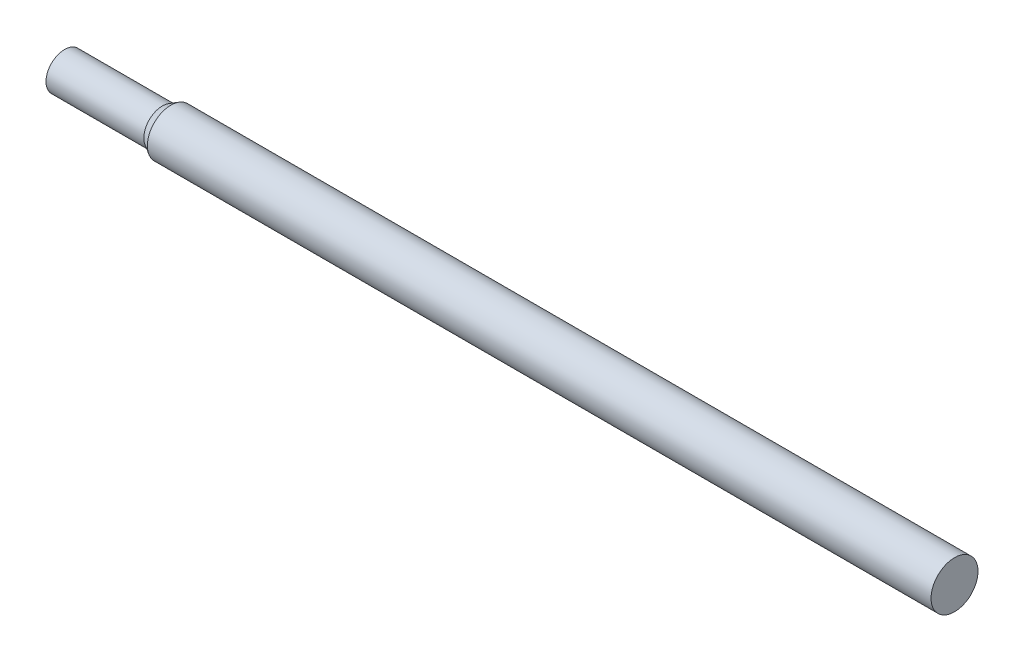
ISO-10303-21;
HEADER;
FILE_DESCRIPTION(('STEP AP214'),'2;1');
FILE_NAME('part.step','',(''),(''),'','','');
FILE_SCHEMA(('AUTOMOTIVE_DESIGN { 1 0 10303 214 1 1 1 1 }'));
ENDSEC;
DATA;
#1=APPLICATION_CONTEXT('core data for automotive mechanical design processes');
#2=APPLICATION_PROTOCOL_DEFINITION('international standard','automotive_design',2000,#1);
#3=PRODUCT_CONTEXT('',#1,'mechanical');
#4=PRODUCT('Part','Part','',(#3));
#5=PRODUCT_RELATED_PRODUCT_CATEGORY('part','',(#4));
#6=PRODUCT_DEFINITION_FORMATION('','',#4);
#7=PRODUCT_DEFINITION_CONTEXT('part definition',#1,'design');
#8=PRODUCT_DEFINITION('design','',#6,#7);
#9=PRODUCT_DEFINITION_SHAPE('','',#8);
#10=(LENGTH_UNIT() NAMED_UNIT(*) SI_UNIT(.MILLI.,.METRE.));
#11=(NAMED_UNIT(*) PLANE_ANGLE_UNIT() SI_UNIT($,.RADIAN.));
#12=(NAMED_UNIT(*) SI_UNIT($,.STERADIAN.) SOLID_ANGLE_UNIT());
#13=UNCERTAINTY_MEASURE_WITH_UNIT(LENGTH_MEASURE(1.E-05),#10,'distance_accuracy_value','');
#14=(GEOMETRIC_REPRESENTATION_CONTEXT(3) GLOBAL_UNCERTAINTY_ASSIGNED_CONTEXT((#13)) GLOBAL_UNIT_ASSIGNED_CONTEXT((#10,
#11,#12)) REPRESENTATION_CONTEXT('',''));
#15=CARTESIAN_POINT('',(0.,0.,0.));
#16=DIRECTION('',(0.,0.,1.));
#17=DIRECTION('',(1.,0.,0.));
#18=AXIS2_PLACEMENT_3D('',#15,#16,#17);
#19=CARTESIAN_POINT('',(910.,0.,0.));
#20=DIRECTION('',(-1.,0.,0.));
#21=DIRECTION('',(0.,0.,1.));
#22=AXIS2_PLACEMENT_3D('',#19,#20,#21);
#23=CYLINDRICAL_SURFACE('',#22,24.);
#24=CARTESIAN_POINT('',(910.,0.,0.));
#25=DIRECTION('',(1.,0.,0.));
#26=DIRECTION('',(0.,0.,-1.));
#27=AXIS2_PLACEMENT_3D('',#24,#25,#26);
#28=CIRCLE('',#27,24.);
#29=CARTESIAN_POINT('',(910.,0.,-24.));
#30=VERTEX_POINT('',#29);
#31=EDGE_CURVE('E10',#30,#30,#28,.T.);
#32=ORIENTED_EDGE('',*,*,#31,.F.);
#33=EDGE_LOOP('',(#32));
#34=FACE_BOUND('',#33,.T.);
#35=CARTESIAN_POINT('',(108.660254037845,0.,0.));
#36=DIRECTION('',(-1.,0.,0.));
#37=DIRECTION('',(0.,0.,1.));
#38=AXIS2_PLACEMENT_3D('',#35,#36,#37);
#39=CIRCLE('',#38,24.);
#40=CARTESIAN_POINT('',(108.660254037845,0.,24.));
#41=VERTEX_POINT('',#40);
#42=EDGE_CURVE('E45',#41,#41,#39,.T.);
#43=ORIENTED_EDGE('',*,*,#42,.F.);
#44=EDGE_LOOP('',(#43));
#45=FACE_BOUND('',#44,.T.);
#46=ADVANCED_FACE('F31',(#34,#45),#23,.T.);
#47=CARTESIAN_POINT('',(910.,0.,0.));
#48=DIRECTION('',(1.,0.,0.));
#49=DIRECTION('',(0.,0.,-1.));
#50=AXIS2_PLACEMENT_3D('',#47,#48,#49);
#51=PLANE('',#50);
#52=ORIENTED_EDGE('',*,*,#31,.T.);
#53=EDGE_LOOP('',(#52));
#54=FACE_BOUND('',#53,.T.);
#55=ADVANCED_FACE('F55',(#54),#51,.T.);
#56=CARTESIAN_POINT('',(0.,0.,0.));
#57=DIRECTION('',(-1.,0.,0.));
#58=DIRECTION('',(0.,0.,1.));
#59=AXIS2_PLACEMENT_3D('',#56,#57,#58);
#60=CYLINDRICAL_SURFACE('',#59,19.);
#61=CARTESIAN_POINT('',(100.,0.,0.));
#62=DIRECTION('',(-1.,0.,0.));
#63=DIRECTION('',(0.,0.,1.));
#64=AXIS2_PLACEMENT_3D('',#61,#62,#63);
#65=CIRCLE('',#64,19.);
#66=CARTESIAN_POINT('',(100.,0.,19.));
#67=VERTEX_POINT('',#66);
#68=EDGE_CURVE('E41',#67,#67,#65,.T.);
#69=ORIENTED_EDGE('',*,*,#68,.T.);
#70=EDGE_LOOP('',(#69));
#71=FACE_BOUND('',#70,.T.);
#72=CARTESIAN_POINT('',(0.,0.,0.));
#73=DIRECTION('',(-1.,0.,0.));
#74=DIRECTION('',(0.,0.,1.));
#75=AXIS2_PLACEMENT_3D('',#72,#73,#74);
#76=CIRCLE('',#75,19.);
#77=CARTESIAN_POINT('',(0.,0.,19.));
#78=VERTEX_POINT('',#77);
#79=EDGE_CURVE('E37',#78,#78,#76,.T.);
#80=ORIENTED_EDGE('',*,*,#79,.F.);
#81=EDGE_LOOP('',(#80));
#82=FACE_BOUND('',#81,.T.);
#83=ADVANCED_FACE('F60',(#71,#82),#60,.T.);
#84=CARTESIAN_POINT('',(100.,0.,0.));
#85=DIRECTION('',(1.,0.,0.));
#86=DIRECTION('',(0.,0.,-1.));
#87=AXIS2_PLACEMENT_3D('',#84,#85,#86);
#88=CONICAL_SURFACE('',#87,19.,0.523598775598294);
#89=ORIENTED_EDGE('',*,*,#42,.T.);
#90=EDGE_LOOP('',(#89));
#91=FACE_BOUND('',#90,.T.);
#92=ORIENTED_EDGE('',*,*,#68,.F.);
#93=EDGE_LOOP('',(#92));
#94=FACE_BOUND('',#93,.T.);
#95=ADVANCED_FACE('F51',(#91,#94),#88,.T.);
#96=CARTESIAN_POINT('',(0.,0.,0.));
#97=DIRECTION('',(1.,0.,0.));
#98=DIRECTION('',(0.,0.,-1.));
#99=AXIS2_PLACEMENT_3D('',#96,#97,#98);
#100=PLANE('',#99);
#101=ORIENTED_EDGE('',*,*,#79,.T.);
#102=EDGE_LOOP('',(#101));
#103=FACE_BOUND('',#102,.T.);
#104=ADVANCED_FACE('F68',(#103),#100,.F.);
#105=CLOSED_SHELL('',(#46,#55,#83,#95,#104));
#106=MANIFOLD_SOLID_BREP('B2',#105);
#107=ADVANCED_BREP_SHAPE_REPRESENTATION('',(#18,#106),#14);
#108=SHAPE_DEFINITION_REPRESENTATION(#9,#107);
ENDSEC;
END-ISO-10303-21;
